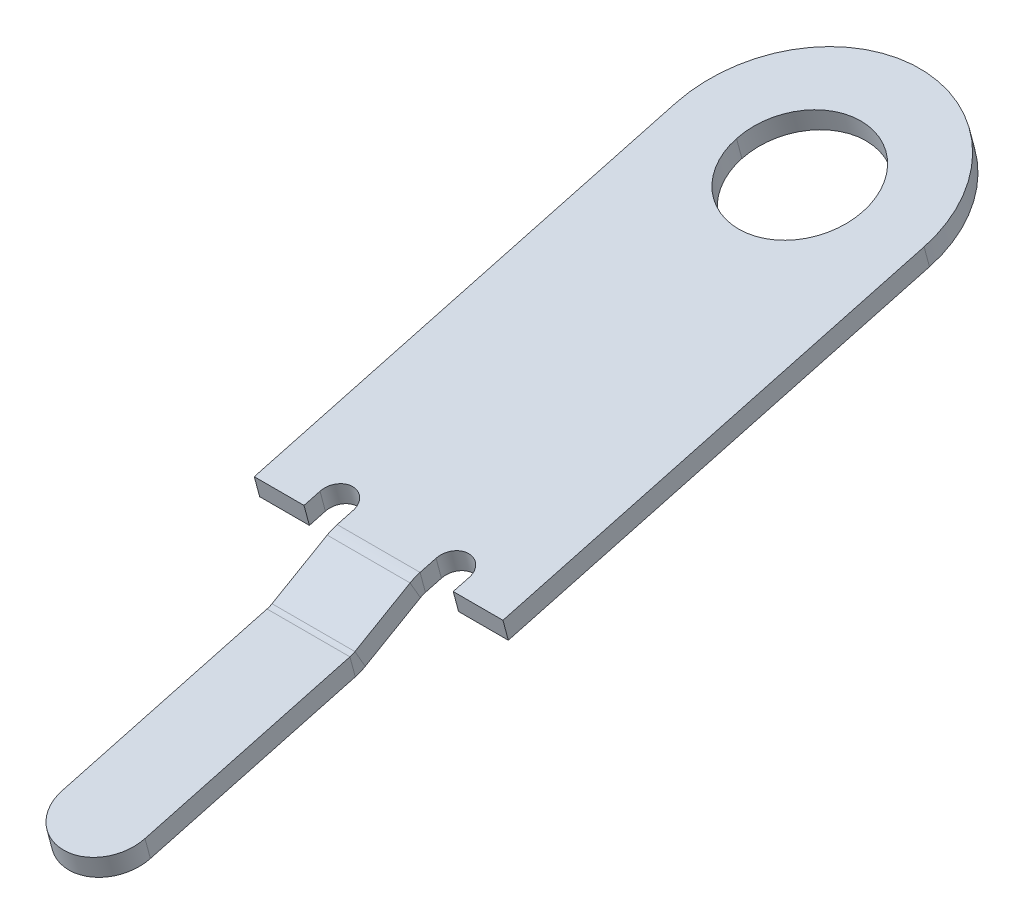
ISO-10303-21;
HEADER;
FILE_DESCRIPTION(('STEP AP214'),'2;1');
FILE_NAME('part.step','',(''),(''),'','','');
FILE_SCHEMA(('AUTOMOTIVE_DESIGN { 1 0 10303 214 1 1 1 1 }'));
ENDSEC;
DATA;
#1=APPLICATION_CONTEXT('core data for automotive mechanical design processes');
#2=APPLICATION_PROTOCOL_DEFINITION('international standard','automotive_design',2000,#1);
#3=PRODUCT_CONTEXT('',#1,'mechanical');
#4=PRODUCT('Part','Part','',(#3));
#5=PRODUCT_RELATED_PRODUCT_CATEGORY('part','',(#4));
#6=PRODUCT_DEFINITION_FORMATION('','',#4);
#7=PRODUCT_DEFINITION_CONTEXT('part definition',#1,'design');
#8=PRODUCT_DEFINITION('design','',#6,#7);
#9=PRODUCT_DEFINITION_SHAPE('','',#8);
#10=(LENGTH_UNIT() NAMED_UNIT(*) SI_UNIT(.MILLI.,.METRE.));
#11=(NAMED_UNIT(*) PLANE_ANGLE_UNIT() SI_UNIT($,.RADIAN.));
#12=(NAMED_UNIT(*) SI_UNIT($,.STERADIAN.) SOLID_ANGLE_UNIT());
#13=UNCERTAINTY_MEASURE_WITH_UNIT(LENGTH_MEASURE(1.E-05),#10,'distance_accuracy_value','');
#14=(GEOMETRIC_REPRESENTATION_CONTEXT(3) GLOBAL_UNCERTAINTY_ASSIGNED_CONTEXT((#13)) GLOBAL_UNIT_ASSIGNED_CONTEXT((#10,
#11,#12)) REPRESENTATION_CONTEXT('',''));
#15=CARTESIAN_POINT('',(0.,0.,0.));
#16=DIRECTION('',(0.,0.,1.));
#17=DIRECTION('',(1.,0.,0.));
#18=AXIS2_PLACEMENT_3D('',#15,#16,#17);
#19=CARTESIAN_POINT('',(0.,-0.7713127426711,8.654454381715));
#20=DIRECTION('',(0.,0.965925826289076,0.258819045102494));
#21=DIRECTION('',(-1.,0.,0.));
#22=AXIS2_PLACEMENT_3D('',#19,#20,#21);
#23=CYLINDRICAL_SURFACE('',#22,0.5);
#24=DIRECTION('',(0.,0.965925826289076,0.258819045102494));
#25=VECTOR('',#24,1.);
#26=CARTESIAN_POINT('',(0.5,-0.8920534709573,8.622102001078));
#27=LINE('',#26,#25);
#28=CARTESIAN_POINT('',(0.5,-0.8920534709573,8.622102001078));
#29=VERTEX_POINT('',#28);
#30=CARTESIAN_POINT('',(0.5,-0.650572014385,8.686806762353));
#31=VERTEX_POINT('',#30);
#32=EDGE_CURVE('E280',#29,#31,#27,.T.);
#33=ORIENTED_EDGE('',*,*,#32,.T.);
#34=CARTESIAN_POINT('',(0.,-0.650572014385,8.686806762353));
#35=DIRECTION('',(0.,-0.965925826289076,-0.258819045102494));
#36=DIRECTION('',(1.,0.,0.));
#37=AXIS2_PLACEMENT_3D('',#34,#35,#36);
#38=CIRCLE('',#37,0.5);
#39=CARTESIAN_POINT('',(-0.5,-0.650572014385,8.686806762353));
#40=VERTEX_POINT('',#39);
#41=EDGE_CURVE('E396',#31,#40,#38,.T.);
#42=ORIENTED_EDGE('',*,*,#41,.T.);
#43=DIRECTION('',(0.,0.965925826289076,0.258819045102494));
#44=VECTOR('',#43,1.);
#45=CARTESIAN_POINT('',(-0.5,-0.8920534709573,8.622102001078));
#46=LINE('',#45,#44);
#47=CARTESIAN_POINT('',(-0.5,-0.8920534709573,8.622102001078));
#48=VERTEX_POINT('',#47);
#49=EDGE_CURVE('E322',#48,#40,#46,.T.);
#50=ORIENTED_EDGE('',*,*,#49,.F.);
#51=CARTESIAN_POINT('',(0.,-0.8920534709573,8.622102001078));
#52=DIRECTION('',(0.,-0.965925826289076,-0.258819045102494));
#53=DIRECTION('',(1.,0.,0.));
#54=AXIS2_PLACEMENT_3D('',#51,#52,#53);
#55=CIRCLE('',#54,0.5);
#56=EDGE_CURVE('E279',#29,#48,#55,.T.);
#57=ORIENTED_EDGE('',*,*,#56,.F.);
#58=EDGE_LOOP('',(#33,#42,#50,#57));
#59=FACE_BOUND('',#58,.T.);
#60=ADVANCED_FACE('F17',(#59),#23,.T.);
#61=CARTESIAN_POINT('',(0.,1.711489338968,0.2554924532504));
#62=DIRECTION('',(0.,-0.965925826289076,-0.258819045102494));
#63=DIRECTION('',(-1.,0.,0.));
#64=AXIS2_PLACEMENT_3D('',#61,#62,#63);
#65=CYLINDRICAL_SURFACE('',#64,0.7625);
#66=DIRECTION('',(0.,0.965925826289076,0.258819045102494));
#67=VECTOR('',#66,1.);
#68=CARTESIAN_POINT('',(0.7625,1.590748610682,0.2231400726126));
#69=LINE('',#68,#67);
#70=CARTESIAN_POINT('',(0.7625,1.590748610682,0.2231400726126));
#71=VERTEX_POINT('',#70);
#72=CARTESIAN_POINT('',(0.7625,1.832230067254,0.2878448338882));
#73=VERTEX_POINT('',#72);
#74=EDGE_CURVE('E11',#71,#73,#69,.T.);
#75=ORIENTED_EDGE('',*,*,#74,.T.);
#76=CARTESIAN_POINT('',(0.,1.832230067254,0.2878448338882));
#77=DIRECTION('',(0.,-0.965925826289076,-0.258819045102494));
#78=DIRECTION('',(-1.,0.,0.));
#79=AXIS2_PLACEMENT_3D('',#76,#77,#78);
#80=CIRCLE('',#79,0.7625);
#81=CARTESIAN_POINT('',(-0.7625,1.832230067254,0.2878448338882));
#82=VERTEX_POINT('',#81);
#83=EDGE_CURVE('E487',#82,#73,#80,.T.);
#84=ORIENTED_EDGE('',*,*,#83,.F.);
#85=DIRECTION('',(0.,0.965925826289076,0.258819045102494));
#86=VECTOR('',#85,1.);
#87=CARTESIAN_POINT('',(-0.7625,1.590748610682,0.2231400726126));
#88=LINE('',#87,#86);
#89=CARTESIAN_POINT('',(-0.7625,1.590748610682,0.2231400726126));
#90=VERTEX_POINT('',#89);
#91=EDGE_CURVE('E25',#90,#82,#88,.T.);
#92=ORIENTED_EDGE('',*,*,#91,.F.);
#93=CARTESIAN_POINT('',(0.,1.590748610682,0.2231400726126));
#94=DIRECTION('',(0.,-0.965925826289076,-0.258819045102494));
#95=DIRECTION('',(-1.,0.,0.));
#96=AXIS2_PLACEMENT_3D('',#93,#94,#95);
#97=CIRCLE('',#96,0.7625);
#98=EDGE_CURVE('E251',#90,#71,#97,.T.);
#99=ORIENTED_EDGE('',*,*,#98,.T.);
#100=EDGE_LOOP('',(#75,#84,#92,#99));
#101=FACE_BOUND('',#100,.T.);
#102=ADVANCED_FACE('F495',(#101),#65,.F.);
#103=CARTESIAN_POINT('',(0.,1.711489338968,0.2554924532504));
#104=DIRECTION('',(0.,-0.965925826289076,-0.258819045102494));
#105=DIRECTION('',(1.,0.,0.));
#106=AXIS2_PLACEMENT_3D('',#103,#104,#105);
#107=CYLINDRICAL_SURFACE('',#106,0.7625);
#108=ORIENTED_EDGE('',*,*,#91,.T.);
#109=CARTESIAN_POINT('',(0.,1.832230067254,0.2878448338882));
#110=DIRECTION('',(0.,-0.965925826289076,-0.258819045102494));
#111=DIRECTION('',(1.,0.,0.));
#112=AXIS2_PLACEMENT_3D('',#109,#110,#111);
#113=CIRCLE('',#112,0.7625);
#114=EDGE_CURVE('E319',#73,#82,#113,.T.);
#115=ORIENTED_EDGE('',*,*,#114,.F.);
#116=ORIENTED_EDGE('',*,*,#74,.F.);
#117=CARTESIAN_POINT('',(0.,1.590748610682,0.2231400726126));
#118=DIRECTION('',(0.,-0.965925826289076,-0.258819045102494));
#119=DIRECTION('',(1.,0.,0.));
#120=AXIS2_PLACEMENT_3D('',#117,#118,#119);
#121=CIRCLE('',#120,0.7625);
#122=EDGE_CURVE('E240',#71,#90,#121,.T.);
#123=ORIENTED_EDGE('',*,*,#122,.T.);
#124=EDGE_LOOP('',(#108,#115,#116,#123));
#125=FACE_BOUND('',#124,.T.);
#126=ADVANCED_FACE('F498',(#125),#107,.F.);
#127=CARTESIAN_POINT('',(1.5,1.030795250349,2.795877376391));
#128=DIRECTION('',(-1.,0.,0.));
#129=DIRECTION('',(0.,0.,1.));
#130=AXIS2_PLACEMENT_3D('',#127,#128,#129);
#131=PLANE('',#130);
#132=DIRECTION('',(0.,0.965925826289076,0.258819045102494));
#133=VECTOR('',#132,1.);
#134=CARTESIAN_POINT('',(1.5,1.590748610682,0.2231400726126));
#135=LINE('',#134,#133);
#136=CARTESIAN_POINT('',(1.5,1.590748610682,0.2231400726126));
#137=VERTEX_POINT('',#136);
#138=CARTESIAN_POINT('',(1.5,1.832230067254,0.2878448338882));
#139=VERTEX_POINT('',#138);
#140=EDGE_CURVE('E318',#137,#139,#135,.T.);
#141=ORIENTED_EDGE('',*,*,#140,.T.);
#142=DIRECTION('',(0.,0.258819045102494,-0.965925826289076));
#143=VECTOR('',#142,1.);
#144=CARTESIAN_POINT('',(1.5,0.4708418900152,5.368614680169));
#145=LINE('',#144,#143);
#146=CARTESIAN_POINT('',(1.5,0.4708418900152,5.368614680169));
#147=VERTEX_POINT('',#146);
#148=EDGE_CURVE('E476',#147,#139,#145,.T.);
#149=ORIENTED_EDGE('',*,*,#148,.F.);
#150=DIRECTION('',(0.,0.965925826289076,0.258819045102494));
#151=VECTOR('',#150,1.);
#152=CARTESIAN_POINT('',(1.5,0.2293604334429,5.303909918893));
#153=LINE('',#152,#151);
#154=CARTESIAN_POINT('',(1.5,0.2293604334429,5.303909918893));
#155=VERTEX_POINT('',#154);
#156=EDGE_CURVE('E403',#155,#147,#153,.T.);
#157=ORIENTED_EDGE('',*,*,#156,.F.);
#158=DIRECTION('',(0.,0.258819045102494,-0.965925826289076));
#159=VECTOR('',#158,1.);
#160=CARTESIAN_POINT('',(1.5,0.2293604334429,5.303909918893));
#161=LINE('',#160,#159);
#162=EDGE_CURVE('E294',#155,#137,#161,.T.);
#163=ORIENTED_EDGE('',*,*,#162,.T.);
#164=EDGE_LOOP('',(#141,#149,#157,#163));
#165=FACE_BOUND('',#164,.T.);
#166=ADVANCED_FACE('F605',(#165),#131,.F.);
#167=CARTESIAN_POINT('',(0.,1.711489338968,0.2554924532504));
#168=DIRECTION('',(0.,0.965925826289076,0.258819045102494));
#169=DIRECTION('',(1.,0.,0.));
#170=AXIS2_PLACEMENT_3D('',#167,#168,#169);
#171=CYLINDRICAL_SURFACE('',#170,1.5);
#172=DIRECTION('',(0.,0.965925826289076,0.258819045102494));
#173=VECTOR('',#172,1.);
#174=CARTESIAN_POINT('',(-1.5,1.590748610682,0.2231400726126));
#175=LINE('',#174,#173);
#176=CARTESIAN_POINT('',(-1.5,1.590748610682,0.2231400726126));
#177=VERTEX_POINT('',#176);
#178=CARTESIAN_POINT('',(-1.5,1.832230067254,0.2878448338882));
#179=VERTEX_POINT('',#178);
#180=EDGE_CURVE('E315',#177,#179,#175,.T.);
#181=ORIENTED_EDGE('',*,*,#180,.T.);
#182=CARTESIAN_POINT('',(0.,1.832230067254,0.2878448338882));
#183=DIRECTION('',(0.,0.965925826289076,0.258819045102494));
#184=DIRECTION('',(1.,0.,0.));
#185=AXIS2_PLACEMENT_3D('',#182,#183,#184);
#186=CIRCLE('',#185,1.5);
#187=EDGE_CURVE('E480',#139,#179,#186,.T.);
#188=ORIENTED_EDGE('',*,*,#187,.F.);
#189=ORIENTED_EDGE('',*,*,#140,.F.);
#190=CARTESIAN_POINT('',(0.,1.590748610682,0.2231400726126));
#191=DIRECTION('',(0.,0.965925826289076,0.258819045102494));
#192=DIRECTION('',(1.,0.,0.));
#193=AXIS2_PLACEMENT_3D('',#190,#191,#192);
#194=CIRCLE('',#193,1.5);
#195=EDGE_CURVE('E266',#137,#177,#194,.T.);
#196=ORIENTED_EDGE('',*,*,#195,.T.);
#197=EDGE_LOOP('',(#181,#188,#189,#196));
#198=FACE_BOUND('',#197,.T.);
#199=ADVANCED_FACE('F581',(#198),#171,.T.);
#200=CARTESIAN_POINT('',(-1.5,1.030795250349,2.795877376391));
#201=DIRECTION('',(1.,0.,0.));
#202=DIRECTION('',(0.,1.,0.));
#203=AXIS2_PLACEMENT_3D('',#200,#201,#202);
#204=PLANE('',#203);
#205=DIRECTION('',(0.,0.965925826289076,0.258819045102494));
#206=VECTOR('',#205,1.);
#207=CARTESIAN_POINT('',(-1.5,0.2293604334429,5.303909918893));
#208=LINE('',#207,#206);
#209=CARTESIAN_POINT('',(-1.5,0.2293604334429,5.303909918893));
#210=VERTEX_POINT('',#209);
#211=CARTESIAN_POINT('',(-1.5,0.4708418900152,5.368614680169));
#212=VERTEX_POINT('',#211);
#213=EDGE_CURVE('E288',#210,#212,#208,.T.);
#214=ORIENTED_EDGE('',*,*,#213,.T.);
#215=DIRECTION('',(0.,-0.258819045102494,0.965925826289076));
#216=VECTOR('',#215,1.);
#217=CARTESIAN_POINT('',(-1.5,1.832230067254,0.2878448338882));
#218=LINE('',#217,#216);
#219=EDGE_CURVE('E484',#179,#212,#218,.T.);
#220=ORIENTED_EDGE('',*,*,#219,.F.);
#221=ORIENTED_EDGE('',*,*,#180,.F.);
#222=DIRECTION('',(0.,-0.258819045102494,0.965925826289076));
#223=VECTOR('',#222,1.);
#224=CARTESIAN_POINT('',(-1.5,1.590748610682,0.2231400726126));
#225=LINE('',#224,#223);
#226=EDGE_CURVE('E284',#177,#210,#225,.T.);
#227=ORIENTED_EDGE('',*,*,#226,.T.);
#228=EDGE_LOOP('',(#214,#220,#221,#227));
#229=FACE_BOUND('',#228,.T.);
#230=ADVANCED_FACE('F578',(#229),#204,.F.);
#231=CARTESIAN_POINT('',(0.,1.832230067254,0.2878448338882));
#232=DIRECTION('',(0.,0.965925826289076,0.258819045102494));
#233=DIRECTION('',(1.,0.,0.));
#234=AXIS2_PLACEMENT_3D('',#231,#232,#233);
#235=PLANE('',#234);
#236=ORIENTED_EDGE('',*,*,#83,.T.);
#237=ORIENTED_EDGE('',*,*,#114,.T.);
#238=EDGE_LOOP('',(#236,#237));
#239=FACE_BOUND('',#238,.T.);
#240=DIRECTION('',(0.,0.258819045102494,-0.965925826289076));
#241=VECTOR('',#240,1.);
#242=CARTESIAN_POINT('',(0.5,0.4708418900152,5.368614680169));
#243=LINE('',#242,#241);
#244=CARTESIAN_POINT('',(0.5,0.4708418900152,5.368614680169));
#245=VERTEX_POINT('',#244);
#246=CARTESIAN_POINT('',(0.5,0.5226056990357,5.175429514911));
#247=VERTEX_POINT('',#246);
#248=EDGE_CURVE('E355',#245,#247,#243,.T.);
#249=ORIENTED_EDGE('',*,*,#248,.T.);
#250=CARTESIAN_POINT('',(0.7,0.5226056990357,5.175429514911));
#251=DIRECTION('',(0.,0.965925826289076,0.258819045102494));
#252=DIRECTION('',(1.,0.,0.));
#253=AXIS2_PLACEMENT_3D('',#250,#251,#252);
#254=CIRCLE('',#253,0.2);
#255=CARTESIAN_POINT('',(0.9,0.5226056990357,5.175429514911));
#256=VERTEX_POINT('',#255);
#257=EDGE_CURVE('E356',#256,#247,#254,.T.);
#258=ORIENTED_EDGE('',*,*,#257,.F.);
#259=DIRECTION('',(0.,0.258819045102494,-0.965925826289076));
#260=VECTOR('',#259,1.);
#261=CARTESIAN_POINT('',(0.9,0.4708418900152,5.368614680169));
#262=LINE('',#261,#260);
#263=CARTESIAN_POINT('',(0.9,0.4708418900152,5.368614680169));
#264=VERTEX_POINT('',#263);
#265=EDGE_CURVE('E292',#264,#256,#262,.T.);
#266=ORIENTED_EDGE('',*,*,#265,.F.);
#267=DIRECTION('',(1.,0.,0.));
#268=VECTOR('',#267,1.);
#269=CARTESIAN_POINT('',(0.9,0.4708418900152,5.368614680169));
#270=LINE('',#269,#268);
#271=EDGE_CURVE('E407',#264,#147,#270,.T.);
#272=ORIENTED_EDGE('',*,*,#271,.T.);
#273=ORIENTED_EDGE('',*,*,#148,.T.);
#274=ORIENTED_EDGE('',*,*,#187,.T.);
#275=ORIENTED_EDGE('',*,*,#219,.T.);
#276=DIRECTION('',(1.,0.,0.));
#277=VECTOR('',#276,1.);
#278=CARTESIAN_POINT('',(-1.5,0.4708418900152,5.368614680169));
#279=LINE('',#278,#277);
#280=CARTESIAN_POINT('',(-0.9,0.4708418900152,5.368614680169));
#281=VERTEX_POINT('',#280);
#282=EDGE_CURVE('E293',#212,#281,#279,.T.);
#283=ORIENTED_EDGE('',*,*,#282,.T.);
#284=DIRECTION('',(0.,0.258819045102494,-0.965925826289076));
#285=VECTOR('',#284,1.);
#286=CARTESIAN_POINT('',(-0.9,0.4708418900152,5.368614680169));
#287=LINE('',#286,#285);
#288=CARTESIAN_POINT('',(-0.9,0.5226056990357,5.175429514911));
#289=VERTEX_POINT('',#288);
#290=EDGE_CURVE('E386',#281,#289,#287,.T.);
#291=ORIENTED_EDGE('',*,*,#290,.T.);
#292=CARTESIAN_POINT('',(-0.7,0.5226056990357,5.175429514911));
#293=DIRECTION('',(0.,0.965925826289076,0.258819045102494));
#294=DIRECTION('',(1.,0.,0.));
#295=AXIS2_PLACEMENT_3D('',#292,#293,#294);
#296=CIRCLE('',#295,0.2);
#297=CARTESIAN_POINT('',(-0.5,0.5226056990357,5.175429514911));
#298=VERTEX_POINT('',#297);
#299=EDGE_CURVE('E376',#298,#289,#296,.T.);
#300=ORIENTED_EDGE('',*,*,#299,.F.);
#301=DIRECTION('',(0.,0.258819045102494,-0.965925826289076));
#302=VECTOR('',#301,1.);
#303=CARTESIAN_POINT('',(-0.5,0.4708418900152,5.368614680169));
#304=LINE('',#303,#302);
#305=CARTESIAN_POINT('',(-0.5,0.4708418900152,5.368614680169));
#306=VERTEX_POINT('',#305);
#307=EDGE_CURVE('E226',#306,#298,#304,.T.);
#308=ORIENTED_EDGE('',*,*,#307,.F.);
#309=DIRECTION('',(1.,0.,0.));
#310=VECTOR('',#309,1.);
#311=CARTESIAN_POINT('',(-0.5,0.4708418900152,5.368614680169));
#312=LINE('',#311,#310);
#313=EDGE_CURVE('E473',#306,#245,#312,.T.);
#314=ORIENTED_EDGE('',*,*,#313,.T.);
#315=EDGE_LOOP('',(#249,#258,#266,#272,#273,#274,#275,#283,#291,#300,#308,#314));
#316=FACE_BOUND('',#315,.T.);
#317=ADVANCED_FACE('F493',(#239,#316),#235,.T.);
#318=CARTESIAN_POINT('',(-0.5,-0.01212102312933,5.239205157617));
#319=DIRECTION('',(1.,0.,0.));
#320=DIRECTION('',(0.,0.965925826289076,0.258819045102494));
#321=AXIS2_PLACEMENT_3D('',#318,#319,#320);
#322=CYLINDRICAL_SURFACE('',#321,0.5);
#323=CARTESIAN_POINT('',(0.5,-0.01212102312933,5.239205157617));
#324=DIRECTION('',(1.,0.,0.));
#325=DIRECTION('',(0.,0.965925826289076,0.258819045102494));
#326=AXIS2_PLACEMENT_3D('',#323,#324,#325);
#327=CIRCLE('',#326,0.5);
#328=CARTESIAN_POINT('',(0.5,0.4208916787629,5.489205157617));
#329=VERTEX_POINT('',#328);
#330=EDGE_CURVE('E387',#245,#329,#327,.T.);
#331=ORIENTED_EDGE('',*,*,#330,.F.);
#332=ORIENTED_EDGE('',*,*,#313,.F.);
#333=CARTESIAN_POINT('',(-0.5,-0.01212102312933,5.239205157617));
#334=DIRECTION('',(-1.,0.,0.));
#335=DIRECTION('',(0.,0.866025403784429,0.500000000000017));
#336=AXIS2_PLACEMENT_3D('',#333,#334,#335);
#337=CIRCLE('',#336,0.5);
#338=CARTESIAN_POINT('',(-0.5,0.4208916787629,5.489205157617));
#339=VERTEX_POINT('',#338);
#340=EDGE_CURVE('E221',#339,#306,#337,.T.);
#341=ORIENTED_EDGE('',*,*,#340,.F.);
#342=DIRECTION('',(1.,0.,0.));
#343=VECTOR('',#342,1.);
#344=CARTESIAN_POINT('',(-0.5,0.4208916787629,5.489205157617));
#345=LINE('',#344,#343);
#346=EDGE_CURVE('E448',#339,#329,#345,.T.);
#347=ORIENTED_EDGE('',*,*,#346,.T.);
#348=EDGE_LOOP('',(#331,#332,#341,#347));
#349=FACE_BOUND('',#348,.T.);
#350=ADVANCED_FACE('F617',(#349),#322,.T.);
#351=CARTESIAN_POINT('',(0.,3.094033268904,0.8591881076668));
#352=DIRECTION('',(0.,0.866025403784429,0.500000000000017));
#353=DIRECTION('',(1.,0.,0.));
#354=AXIS2_PLACEMENT_3D('',#351,#352,#353);
#355=PLANE('',#354);
#356=DIRECTION('',(0.,-0.500000000000017,0.866025403784429));
#357=VECTOR('',#356,1.);
#358=CARTESIAN_POINT('',(0.5,0.4208916787629,5.489205157617));
#359=LINE('',#358,#357);
#360=CARTESIAN_POINT('',(0.5,0.03677057268251,6.154522429608));
#361=VERTEX_POINT('',#360);
#362=EDGE_CURVE('E435',#329,#361,#359,.T.);
#363=ORIENTED_EDGE('',*,*,#362,.F.);
#364=ORIENTED_EDGE('',*,*,#346,.F.);
#365=DIRECTION('',(0.,0.500000000000017,-0.866025403784429));
#366=VECTOR('',#365,1.);
#367=CARTESIAN_POINT('',(-0.5,0.03677057268251,6.154522429608));
#368=LINE('',#367,#366);
#369=CARTESIAN_POINT('',(-0.5,0.03677057268251,6.154522429608));
#370=VERTEX_POINT('',#369);
#371=EDGE_CURVE('E373',#370,#339,#368,.T.);
#372=ORIENTED_EDGE('',*,*,#371,.F.);
#373=DIRECTION('',(1.,0.,0.));
#374=VECTOR('',#373,1.);
#375=CARTESIAN_POINT('',(-0.5,0.03677057268251,6.154522429608));
#376=LINE('',#375,#374);
#377=EDGE_CURVE('E445',#370,#361,#376,.T.);
#378=ORIENTED_EDGE('',*,*,#377,.T.);
#379=EDGE_LOOP('',(#363,#364,#372,#378));
#380=FACE_BOUND('',#379,.T.);
#381=ADVANCED_FACE('F554',(#380),#355,.T.);
#382=CARTESIAN_POINT('',(0.5,0.2532769236286,6.279522429608));
#383=DIRECTION('',(-1.,0.,0.));
#384=DIRECTION('',(0.,0.965925826289076,0.258819045102494));
#385=AXIS2_PLACEMENT_3D('',#382,#383,#384);
#386=CYLINDRICAL_SURFACE('',#385,0.25);
#387=CARTESIAN_POINT('',(-0.5,0.2532769236286,6.279522429608));
#388=DIRECTION('',(1.,0.,0.));
#389=DIRECTION('',(0.,-0.965925826289076,-0.258819045102494));
#390=AXIS2_PLACEMENT_3D('',#387,#388,#389);
#391=CIRCLE('',#390,0.25);
#392=CARTESIAN_POINT('',(-0.5,0.01179546705635,6.214817668333));
#393=VERTEX_POINT('',#392);
#394=EDGE_CURVE('E303',#393,#370,#391,.T.);
#395=ORIENTED_EDGE('',*,*,#394,.F.);
#396=DIRECTION('',(1.,0.,0.));
#397=VECTOR('',#396,1.);
#398=CARTESIAN_POINT('',(-0.5,0.01179546705635,6.214817668333));
#399=LINE('',#398,#397);
#400=CARTESIAN_POINT('',(0.5,0.01179546705635,6.214817668333));
#401=VERTEX_POINT('',#400);
#402=EDGE_CURVE('E399',#393,#401,#399,.T.);
#403=ORIENTED_EDGE('',*,*,#402,.T.);
#404=CARTESIAN_POINT('',(0.5,0.2532769236286,6.279522429608));
#405=DIRECTION('',(-1.,0.,0.));
#406=DIRECTION('',(0.,-0.866025403784429,-0.500000000000017));
#407=AXIS2_PLACEMENT_3D('',#404,#405,#406);
#408=CIRCLE('',#407,0.25);
#409=EDGE_CURVE('E429',#361,#401,#408,.T.);
#410=ORIENTED_EDGE('',*,*,#409,.F.);
#411=ORIENTED_EDGE('',*,*,#377,.F.);
#412=EDGE_LOOP('',(#395,#403,#410,#411));
#413=FACE_BOUND('',#412,.T.);
#414=ADVANCED_FACE('F538',(#413),#386,.F.);
#415=CARTESIAN_POINT('',(0.,1.616682820713,0.2252965240609));
#416=DIRECTION('',(0.,0.965925826289076,0.258819045102494));
#417=DIRECTION('',(1.,0.,0.));
#418=AXIS2_PLACEMENT_3D('',#415,#416,#417);
#419=PLANE('',#418);
#420=DIRECTION('',(0.,0.258819045102494,-0.965925826289076));
#421=VECTOR('',#420,1.);
#422=CARTESIAN_POINT('',(-0.5,-0.650572014385,8.686806762353));
#423=LINE('',#422,#421);
#424=EDGE_CURVE('E326',#40,#393,#423,.T.);
#425=ORIENTED_EDGE('',*,*,#424,.F.);
#426=ORIENTED_EDGE('',*,*,#41,.F.);
#427=DIRECTION('',(0.,-0.258819045102494,0.965925826289076));
#428=VECTOR('',#427,1.);
#429=CARTESIAN_POINT('',(0.5,0.01179546705635,6.214817668333));
#430=LINE('',#429,#428);
#431=EDGE_CURVE('E454',#401,#31,#430,.T.);
#432=ORIENTED_EDGE('',*,*,#431,.F.);
#433=ORIENTED_EDGE('',*,*,#402,.F.);
#434=EDGE_LOOP('',(#425,#426,#432,#433));
#435=FACE_BOUND('',#434,.T.);
#436=ADVANCED_FACE('F522',(#435),#419,.T.);
#437=CARTESIAN_POINT('',(-0.5,-0.3183794137417,6.964084185709));
#438=DIRECTION('',(1.,0.,0.));
#439=DIRECTION('',(0.,1.,0.));
#440=AXIS2_PLACEMENT_3D('',#437,#438,#439);
#441=PLANE('',#440);
#442=DIRECTION('',(0.,0.258819045102494,-0.965925826289076));
#443=VECTOR('',#442,1.);
#444=CARTESIAN_POINT('',(-0.5,-0.8920534709573,8.622102001078));
#445=LINE('',#444,#443);
#446=CARTESIAN_POINT('',(-0.5,-0.2296859895159,6.150112907057));
#447=VERTEX_POINT('',#446);
#448=EDGE_CURVE('E327',#48,#447,#445,.T.);
#449=ORIENTED_EDGE('',*,*,#448,.F.);
#450=ORIENTED_EDGE('',*,*,#49,.T.);
#451=ORIENTED_EDGE('',*,*,#424,.T.);
#452=DIRECTION('',(0.,-0.965925826289076,-0.258819045102494));
#453=VECTOR('',#452,1.);
#454=CARTESIAN_POINT('',(-0.5,0.01179546705635,6.214817668333));
#455=LINE('',#454,#453);
#456=EDGE_CURVE('E299',#393,#447,#455,.T.);
#457=ORIENTED_EDGE('',*,*,#456,.T.);
#458=EDGE_LOOP('',(#449,#450,#451,#457));
#459=FACE_BOUND('',#458,.T.);
#460=ADVANCED_FACE('F526',(#459),#441,.F.);
#461=CARTESIAN_POINT('',(0.,1.375201364141,0.1605917627853));
#462=DIRECTION('',(0.,0.965925826289076,0.258819045102494));
#463=DIRECTION('',(1.,0.,0.));
#464=AXIS2_PLACEMENT_3D('',#461,#462,#463);
#465=PLANE('',#464);
#466=DIRECTION('',(0.,-0.258819045102494,0.965925826289076));
#467=VECTOR('',#466,1.);
#468=CARTESIAN_POINT('',(0.5,-0.2296859895159,6.150112907057));
#469=LINE('',#468,#467);
#470=CARTESIAN_POINT('',(0.5,-0.2296859895159,6.150112907057));
#471=VERTEX_POINT('',#470);
#472=EDGE_CURVE('E275',#471,#29,#469,.T.);
#473=ORIENTED_EDGE('',*,*,#472,.T.);
#474=ORIENTED_EDGE('',*,*,#56,.T.);
#475=ORIENTED_EDGE('',*,*,#448,.T.);
#476=DIRECTION('',(1.,0.,0.));
#477=VECTOR('',#476,1.);
#478=CARTESIAN_POINT('',(-0.5,-0.2296859895159,6.150112907057));
#479=LINE('',#478,#477);
#480=EDGE_CURVE('E334',#447,#471,#479,.T.);
#481=ORIENTED_EDGE('',*,*,#480,.T.);
#482=EDGE_LOOP('',(#473,#474,#475,#481));
#483=FACE_BOUND('',#482,.T.);
#484=ADVANCED_FACE('F530',(#483),#465,.F.);
#485=CARTESIAN_POINT('',(0.5,-0.3183794137417,6.964084185709));
#486=DIRECTION('',(-1.,0.,0.));
#487=DIRECTION('',(0.,0.,1.));
#488=AXIS2_PLACEMENT_3D('',#485,#486,#487);
#489=PLANE('',#488);
#490=ORIENTED_EDGE('',*,*,#431,.T.);
#491=ORIENTED_EDGE('',*,*,#32,.F.);
#492=ORIENTED_EDGE('',*,*,#472,.F.);
#493=DIRECTION('',(0.,-0.965925826289076,-0.258819045102494));
#494=VECTOR('',#493,1.);
#495=CARTESIAN_POINT('',(0.5,0.01179546705635,6.214817668333));
#496=LINE('',#495,#494);
#497=EDGE_CURVE('E433',#401,#471,#496,.T.);
#498=ORIENTED_EDGE('',*,*,#497,.F.);
#499=EDGE_LOOP('',(#490,#491,#492,#498));
#500=FACE_BOUND('',#499,.T.);
#501=ADVANCED_FACE('F520',(#500),#489,.F.);
#502=CARTESIAN_POINT('',(0.5,-0.3183794137417,6.964084185709));
#503=DIRECTION('',(-1.,0.,0.));
#504=DIRECTION('',(0.,0.,1.));
#505=AXIS2_PLACEMENT_3D('',#502,#503,#504);
#506=PLANE('',#505);
#507=ORIENTED_EDGE('',*,*,#409,.T.);
#508=ORIENTED_EDGE('',*,*,#497,.T.);
#509=CARTESIAN_POINT('',(0.5,0.2532769236286,6.279522429608));
#510=DIRECTION('',(-1.,0.,0.));
#511=DIRECTION('',(0.,-0.866025403784429,-0.500000000000017));
#512=AXIS2_PLACEMENT_3D('',#509,#510,#511);
#513=CIRCLE('',#512,0.5);
#514=CARTESIAN_POINT('',(0.5,-0.1797357782636,6.029522429608));
#515=VERTEX_POINT('',#514);
#516=EDGE_CURVE('E330',#515,#471,#513,.T.);
#517=ORIENTED_EDGE('',*,*,#516,.F.);
#518=DIRECTION('',(0.,-0.866025403784429,-0.500000000000017));
#519=VECTOR('',#518,1.);
#520=CARTESIAN_POINT('',(0.5,0.03677057268251,6.154522429608));
#521=LINE('',#520,#519);
#522=EDGE_CURVE('E434',#361,#515,#521,.T.);
#523=ORIENTED_EDGE('',*,*,#522,.F.);
#524=EDGE_LOOP('',(#507,#508,#517,#523));
#525=FACE_BOUND('',#524,.T.);
#526=ADVANCED_FACE('F534',(#525),#506,.F.);
#527=CARTESIAN_POINT('',(0.5,-0.5192199065686,6.867526188196));
#528=DIRECTION('',(-1.,0.,0.));
#529=DIRECTION('',(0.,0.,1.));
#530=AXIS2_PLACEMENT_3D('',#527,#528,#529);
#531=PLANE('',#530);
#532=DIRECTION('',(0.,-0.500000000000017,0.866025403784429));
#533=VECTOR('',#532,1.);
#534=CARTESIAN_POINT('',(0.5,0.2043853278168,5.364205157617));
#535=LINE('',#534,#533);
#536=CARTESIAN_POINT('',(0.5,0.2043853278168,5.364205157617));
#537=VERTEX_POINT('',#536);
#538=EDGE_CURVE('E344',#537,#515,#535,.T.);
#539=ORIENTED_EDGE('',*,*,#538,.F.);
#540=DIRECTION('',(0.,-0.866025403784429,-0.500000000000017));
#541=VECTOR('',#540,1.);
#542=CARTESIAN_POINT('',(0.5,0.4208916787629,5.489205157617));
#543=LINE('',#542,#541);
#544=EDGE_CURVE('E391',#329,#537,#543,.T.);
#545=ORIENTED_EDGE('',*,*,#544,.F.);
#546=ORIENTED_EDGE('',*,*,#362,.T.);
#547=ORIENTED_EDGE('',*,*,#522,.T.);
#548=EDGE_LOOP('',(#539,#545,#546,#547));
#549=FACE_BOUND('',#548,.T.);
#550=ADVANCED_FACE('F551',(#549),#531,.F.);
#551=CARTESIAN_POINT('',(0.5,-0.1028321672003,7.026632495537));
#552=DIRECTION('',(-1.,0.,0.));
#553=DIRECTION('',(0.,0.,1.));
#554=AXIS2_PLACEMENT_3D('',#551,#552,#553);
#555=PLANE('',#554);
#556=CARTESIAN_POINT('',(0.5,-0.01212102312933,5.239205157617));
#557=DIRECTION('',(1.,0.,0.));
#558=DIRECTION('',(0.,0.965925826289076,0.258819045102494));
#559=AXIS2_PLACEMENT_3D('',#556,#557,#558);
#560=CIRCLE('',#559,0.25);
#561=CARTESIAN_POINT('',(0.5,0.2293604334429,5.303909918893));
#562=VERTEX_POINT('',#561);
#563=EDGE_CURVE('E239',#562,#537,#560,.T.);
#564=ORIENTED_EDGE('',*,*,#563,.F.);
#565=DIRECTION('',(0.,-0.965925826289076,-0.258819045102494));
#566=VECTOR('',#565,1.);
#567=CARTESIAN_POINT('',(0.5,0.4708418900152,5.368614680169));
#568=LINE('',#567,#566);
#569=EDGE_CURVE('E392',#245,#562,#568,.T.);
#570=ORIENTED_EDGE('',*,*,#569,.F.);
#571=ORIENTED_EDGE('',*,*,#330,.T.);
#572=ORIENTED_EDGE('',*,*,#544,.T.);
#573=EDGE_LOOP('',(#564,#570,#571,#572));
#574=FACE_BOUND('',#573,.T.);
#575=ADVANCED_FACE('F596',(#574),#555,.F.);
#576=CARTESIAN_POINT('',(0.5,0.3759830662393,5.239669716902));
#577=DIRECTION('',(-1.,0.,0.));
#578=DIRECTION('',(0.,0.,1.));
#579=AXIS2_PLACEMENT_3D('',#576,#577,#578);
#580=PLANE('',#579);
#581=DIRECTION('',(0.,0.258819045102494,-0.965925826289076));
#582=VECTOR('',#581,1.);
#583=CARTESIAN_POINT('',(0.5,0.2293604334429,5.303909918893));
#584=LINE('',#583,#582);
#585=CARTESIAN_POINT('',(0.5,0.2811242424634,5.110724753635));
#586=VERTEX_POINT('',#585);
#587=EDGE_CURVE('E249',#562,#586,#584,.T.);
#588=ORIENTED_EDGE('',*,*,#587,.T.);
#589=DIRECTION('',(0.,0.965925826289076,0.258819045102494));
#590=VECTOR('',#589,1.);
#591=CARTESIAN_POINT('',(0.5,0.2811242424634,5.110724753635));
#592=LINE('',#591,#590);
#593=EDGE_CURVE('E351',#586,#247,#592,.T.);
#594=ORIENTED_EDGE('',*,*,#593,.T.);
#595=ORIENTED_EDGE('',*,*,#248,.F.);
#596=ORIENTED_EDGE('',*,*,#569,.T.);
#597=EDGE_LOOP('',(#588,#594,#595,#596));
#598=FACE_BOUND('',#597,.T.);
#599=ADVANCED_FACE('F592',(#598),#580,.F.);
#600=CARTESIAN_POINT('',(0.7,0.4018649707496,5.143077134273));
#601=DIRECTION('',(0.,0.965925826289076,0.258819045102494));
#602=DIRECTION('',(1.,0.,0.));
#603=AXIS2_PLACEMENT_3D('',#600,#601,#602);
#604=CYLINDRICAL_SURFACE('',#603,0.2);
#605=DIRECTION('',(0.,0.965925826289076,0.258819045102494));
#606=VECTOR('',#605,1.);
#607=CARTESIAN_POINT('',(0.9,0.2811242424634,5.110724753635));
#608=LINE('',#607,#606);
#609=CARTESIAN_POINT('',(0.9,0.2811242424634,5.110724753635));
#610=VERTEX_POINT('',#609);
#611=EDGE_CURVE('E420',#610,#256,#608,.T.);
#612=ORIENTED_EDGE('',*,*,#611,.T.);
#613=ORIENTED_EDGE('',*,*,#257,.T.);
#614=ORIENTED_EDGE('',*,*,#593,.F.);
#615=CARTESIAN_POINT('',(0.7,0.2811242424634,5.110724753635));
#616=DIRECTION('',(0.,0.965925826289076,0.258819045102494));
#617=DIRECTION('',(1.,0.,0.));
#618=AXIS2_PLACEMENT_3D('',#615,#616,#617);
#619=CIRCLE('',#618,0.2);
#620=EDGE_CURVE('E312',#610,#586,#619,.T.);
#621=ORIENTED_EDGE('',*,*,#620,.F.);
#622=EDGE_LOOP('',(#612,#613,#614,#621));
#623=FACE_BOUND('',#622,.T.);
#624=ADVANCED_FACE('F589',(#623),#604,.F.);
#625=CARTESIAN_POINT('',(0.9,0.3759830662393,5.239669716902));
#626=DIRECTION('',(-1.,0.,0.));
#627=DIRECTION('',(0.,0.,1.));
#628=AXIS2_PLACEMENT_3D('',#625,#626,#627);
#629=PLANE('',#628);
#630=DIRECTION('',(0.,0.965925826289076,0.258819045102494));
#631=VECTOR('',#630,1.);
#632=CARTESIAN_POINT('',(0.9,0.2293604334429,5.303909918893));
#633=LINE('',#632,#631);
#634=CARTESIAN_POINT('',(0.9,0.2293604334429,5.303909918893));
#635=VERTEX_POINT('',#634);
#636=EDGE_CURVE('E411',#635,#264,#633,.T.);
#637=ORIENTED_EDGE('',*,*,#636,.T.);
#638=ORIENTED_EDGE('',*,*,#265,.T.);
#639=ORIENTED_EDGE('',*,*,#611,.F.);
#640=DIRECTION('',(0.,0.258819045102494,-0.965925826289076));
#641=VECTOR('',#640,1.);
#642=CARTESIAN_POINT('',(0.9,0.2293604334429,5.303909918893));
#643=LINE('',#642,#641);
#644=EDGE_CURVE('E308',#635,#610,#643,.T.);
#645=ORIENTED_EDGE('',*,*,#644,.F.);
#646=EDGE_LOOP('',(#637,#638,#639,#645));
#647=FACE_BOUND('',#646,.T.);
#648=ADVANCED_FACE('F587',(#647),#629,.T.);
#649=CARTESIAN_POINT('',(0.,0.3501011617291,5.336262299531));
#650=DIRECTION('',(0.,0.258819045102494,-0.965925826289076));
#651=DIRECTION('',(-1.,0.,0.));
#652=AXIS2_PLACEMENT_3D('',#649,#650,#651);
#653=PLANE('',#652);
#654=ORIENTED_EDGE('',*,*,#282,.F.);
#655=ORIENTED_EDGE('',*,*,#213,.F.);
#656=DIRECTION('',(1.,0.,0.));
#657=VECTOR('',#656,1.);
#658=CARTESIAN_POINT('',(-1.5,0.2293604334429,5.303909918893));
#659=LINE('',#658,#657);
#660=CARTESIAN_POINT('',(-0.9,0.2293604334429,5.303909918893));
#661=VERTEX_POINT('',#660);
#662=EDGE_CURVE('E272',#210,#661,#659,.T.);
#663=ORIENTED_EDGE('',*,*,#662,.T.);
#664=DIRECTION('',(0.,0.965925826289076,0.258819045102494));
#665=VECTOR('',#664,1.);
#666=CARTESIAN_POINT('',(-0.9,0.2293604334429,5.303909918893));
#667=LINE('',#666,#665);
#668=EDGE_CURVE('E395',#661,#281,#667,.T.);
#669=ORIENTED_EDGE('',*,*,#668,.T.);
#670=EDGE_LOOP('',(#654,#655,#663,#669));
#671=FACE_BOUND('',#670,.T.);
#672=ADVANCED_FACE('F583',(#671),#653,.F.);
#673=CARTESIAN_POINT('',(0.,0.3501011617291,5.336262299531));
#674=DIRECTION('',(0.,0.258819045102494,-0.965925826289076));
#675=DIRECTION('',(-1.,0.,0.));
#676=AXIS2_PLACEMENT_3D('',#673,#674,#675);
#677=PLANE('',#676);
#678=DIRECTION('',(1.,0.,0.));
#679=VECTOR('',#678,1.);
#680=CARTESIAN_POINT('',(0.9,0.2293604334429,5.303909918893));
#681=LINE('',#680,#679);
#682=EDGE_CURVE('E298',#635,#155,#681,.T.);
#683=ORIENTED_EDGE('',*,*,#682,.T.);
#684=ORIENTED_EDGE('',*,*,#156,.T.);
#685=ORIENTED_EDGE('',*,*,#271,.F.);
#686=ORIENTED_EDGE('',*,*,#636,.F.);
#687=EDGE_LOOP('',(#683,#684,#685,#686));
#688=FACE_BOUND('',#687,.T.);
#689=ADVANCED_FACE('F586',(#688),#677,.F.);
#690=CARTESIAN_POINT('',(-0.9,0.3759830662393,5.239669716902));
#691=DIRECTION('',(-1.,0.,0.));
#692=DIRECTION('',(0.,0.,1.));
#693=AXIS2_PLACEMENT_3D('',#690,#691,#692);
#694=PLANE('',#693);
#695=DIRECTION('',(0.,0.965925826289076,0.258819045102494));
#696=VECTOR('',#695,1.);
#697=CARTESIAN_POINT('',(-0.9,0.2811242424634,5.110724753635));
#698=LINE('',#697,#696);
#699=CARTESIAN_POINT('',(-0.9,0.2811242424634,5.110724753635));
#700=VERTEX_POINT('',#699);
#701=EDGE_CURVE('E380',#700,#289,#698,.T.);
#702=ORIENTED_EDGE('',*,*,#701,.T.);
#703=ORIENTED_EDGE('',*,*,#290,.F.);
#704=ORIENTED_EDGE('',*,*,#668,.F.);
#705=DIRECTION('',(0.,0.258819045102494,-0.965925826289076));
#706=VECTOR('',#705,1.);
#707=CARTESIAN_POINT('',(-0.9,0.2293604334429,5.303909918893));
#708=LINE('',#707,#706);
#709=EDGE_CURVE('E263',#661,#700,#708,.T.);
#710=ORIENTED_EDGE('',*,*,#709,.T.);
#711=EDGE_LOOP('',(#702,#703,#704,#710));
#712=FACE_BOUND('',#711,.T.);
#713=ADVANCED_FACE('F570',(#712),#694,.F.);
#714=CARTESIAN_POINT('',(-0.7,0.4018649707496,5.143077134273));
#715=DIRECTION('',(0.,0.965925826289076,0.258819045102494));
#716=DIRECTION('',(1.,0.,0.));
#717=AXIS2_PLACEMENT_3D('',#714,#715,#716);
#718=CYLINDRICAL_SURFACE('',#717,0.2);
#719=DIRECTION('',(0.,0.965925826289076,0.258819045102494));
#720=VECTOR('',#719,1.);
#721=CARTESIAN_POINT('',(-0.5,0.2811242424634,5.110724753635));
#722=LINE('',#721,#720);
#723=CARTESIAN_POINT('',(-0.5,0.2811242424634,5.110724753635));
#724=VERTEX_POINT('',#723);
#725=EDGE_CURVE('E255',#724,#298,#722,.T.);
#726=ORIENTED_EDGE('',*,*,#725,.T.);
#727=ORIENTED_EDGE('',*,*,#299,.T.);
#728=ORIENTED_EDGE('',*,*,#701,.F.);
#729=CARTESIAN_POINT('',(-0.7,0.2811242424634,5.110724753635));
#730=DIRECTION('',(0.,0.965925826289076,0.258819045102494));
#731=DIRECTION('',(1.,0.,0.));
#732=AXIS2_PLACEMENT_3D('',#729,#730,#731);
#733=CIRCLE('',#732,0.2);
#734=EDGE_CURVE('E258',#724,#700,#733,.T.);
#735=ORIENTED_EDGE('',*,*,#734,.F.);
#736=EDGE_LOOP('',(#726,#727,#728,#735));
#737=FACE_BOUND('',#736,.T.);
#738=ADVANCED_FACE('F574',(#737),#718,.F.);
#739=CARTESIAN_POINT('',(-0.5,0.3759830662393,5.239669716902));
#740=DIRECTION('',(-1.,0.,0.));
#741=DIRECTION('',(0.,0.,1.));
#742=AXIS2_PLACEMENT_3D('',#739,#740,#741);
#743=PLANE('',#742);
#744=ORIENTED_EDGE('',*,*,#307,.T.);
#745=ORIENTED_EDGE('',*,*,#725,.F.);
#746=DIRECTION('',(0.,0.258819045102494,-0.965925826289076));
#747=VECTOR('',#746,1.);
#748=CARTESIAN_POINT('',(-0.5,0.2293604334429,5.303909918893));
#749=LINE('',#748,#747);
#750=CARTESIAN_POINT('',(-0.5,0.2293604334429,5.303909918893));
#751=VERTEX_POINT('',#750);
#752=EDGE_CURVE('E246',#751,#724,#749,.T.);
#753=ORIENTED_EDGE('',*,*,#752,.F.);
#754=DIRECTION('',(0.,-0.965925826289076,-0.258819045102494));
#755=VECTOR('',#754,1.);
#756=CARTESIAN_POINT('',(-0.5,0.4708418900152,5.368614680169));
#757=LINE('',#756,#755);
#758=EDGE_CURVE('E215',#306,#751,#757,.T.);
#759=ORIENTED_EDGE('',*,*,#758,.F.);
#760=EDGE_LOOP('',(#744,#745,#753,#759));
#761=FACE_BOUND('',#760,.T.);
#762=ADVANCED_FACE('F253',(#761),#743,.T.);
#763=CARTESIAN_POINT('',(-0.5,-0.1028321672003,7.026632495537));
#764=DIRECTION('',(1.,0.,0.));
#765=DIRECTION('',(0.,1.,0.));
#766=AXIS2_PLACEMENT_3D('',#763,#764,#765);
#767=PLANE('',#766);
#768=ORIENTED_EDGE('',*,*,#340,.T.);
#769=ORIENTED_EDGE('',*,*,#758,.T.);
#770=CARTESIAN_POINT('',(-0.5,-0.01212102312933,5.239205157617));
#771=DIRECTION('',(-1.,0.,0.));
#772=DIRECTION('',(0.,0.866025403784429,0.500000000000017));
#773=AXIS2_PLACEMENT_3D('',#770,#771,#772);
#774=CIRCLE('',#773,0.25);
#775=CARTESIAN_POINT('',(-0.5,0.2043853278168,5.364205157617));
#776=VERTEX_POINT('',#775);
#777=EDGE_CURVE('E219',#776,#751,#774,.T.);
#778=ORIENTED_EDGE('',*,*,#777,.F.);
#779=DIRECTION('',(0.,-0.866025403784429,-0.500000000000017));
#780=VECTOR('',#779,1.);
#781=CARTESIAN_POINT('',(-0.5,0.4208916787629,5.489205157617));
#782=LINE('',#781,#780);
#783=EDGE_CURVE('E311',#339,#776,#782,.T.);
#784=ORIENTED_EDGE('',*,*,#783,.F.);
#785=EDGE_LOOP('',(#768,#769,#778,#784));
#786=FACE_BOUND('',#785,.T.);
#787=ADVANCED_FACE('F217',(#786),#767,.F.);
#788=CARTESIAN_POINT('',(-0.5,-0.5192199065686,6.867526188196));
#789=DIRECTION('',(1.,0.,0.));
#790=DIRECTION('',(0.,1.,0.));
#791=AXIS2_PLACEMENT_3D('',#788,#789,#790);
#792=PLANE('',#791);
#793=ORIENTED_EDGE('',*,*,#371,.T.);
#794=ORIENTED_EDGE('',*,*,#783,.T.);
#795=DIRECTION('',(0.,0.500000000000017,-0.866025403784429));
#796=VECTOR('',#795,1.);
#797=CARTESIAN_POINT('',(-0.5,-0.1797357782636,6.029522429608));
#798=LINE('',#797,#796);
#799=CARTESIAN_POINT('',(-0.5,-0.1797357782636,6.029522429608));
#800=VERTEX_POINT('',#799);
#801=EDGE_CURVE('E340',#800,#776,#798,.T.);
#802=ORIENTED_EDGE('',*,*,#801,.F.);
#803=DIRECTION('',(0.,-0.866025403784429,-0.500000000000017));
#804=VECTOR('',#803,1.);
#805=CARTESIAN_POINT('',(-0.5,0.03677057268251,6.154522429608));
#806=LINE('',#805,#804);
#807=EDGE_CURVE('E370',#370,#800,#806,.T.);
#808=ORIENTED_EDGE('',*,*,#807,.F.);
#809=EDGE_LOOP('',(#793,#794,#802,#808));
#810=FACE_BOUND('',#809,.T.);
#811=ADVANCED_FACE('F559',(#810),#792,.F.);
#812=CARTESIAN_POINT('',(-0.5,-0.3183794137417,6.964084185709));
#813=DIRECTION('',(1.,0.,0.));
#814=DIRECTION('',(0.,1.,0.));
#815=AXIS2_PLACEMENT_3D('',#812,#813,#814);
#816=PLANE('',#815);
#817=CARTESIAN_POINT('',(-0.5,0.2532769236286,6.279522429608));
#818=DIRECTION('',(1.,0.,0.));
#819=DIRECTION('',(0.,-0.965925826289076,-0.258819045102494));
#820=AXIS2_PLACEMENT_3D('',#817,#818,#819);
#821=CIRCLE('',#820,0.5);
#822=EDGE_CURVE('E304',#447,#800,#821,.T.);
#823=ORIENTED_EDGE('',*,*,#822,.F.);
#824=ORIENTED_EDGE('',*,*,#456,.F.);
#825=ORIENTED_EDGE('',*,*,#394,.T.);
#826=ORIENTED_EDGE('',*,*,#807,.T.);
#827=EDGE_LOOP('',(#823,#824,#825,#826));
#828=FACE_BOUND('',#827,.T.);
#829=ADVANCED_FACE('F541',(#828),#816,.F.);
#830=CARTESIAN_POINT('',(0.5,0.2532769236286,6.279522429608));
#831=DIRECTION('',(-1.,0.,0.));
#832=DIRECTION('',(0.,0.965925826289076,0.258819045102494));
#833=AXIS2_PLACEMENT_3D('',#830,#831,#832);
#834=CYLINDRICAL_SURFACE('',#833,0.5);
#835=ORIENTED_EDGE('',*,*,#516,.T.);
#836=ORIENTED_EDGE('',*,*,#480,.F.);
#837=ORIENTED_EDGE('',*,*,#822,.T.);
#838=DIRECTION('',(1.,0.,0.));
#839=VECTOR('',#838,1.);
#840=CARTESIAN_POINT('',(-0.5,-0.1797357782636,6.029522429608));
#841=LINE('',#840,#839);
#842=EDGE_CURVE('E335',#800,#515,#841,.T.);
#843=ORIENTED_EDGE('',*,*,#842,.T.);
#844=EDGE_LOOP('',(#835,#836,#837,#843));
#845=FACE_BOUND('',#844,.T.);
#846=ADVANCED_FACE('F545',(#845),#834,.T.);
#847=CARTESIAN_POINT('',(0.,2.877526917958,0.7341881076668));
#848=DIRECTION('',(0.,0.866025403784429,0.500000000000017));
#849=DIRECTION('',(1.,0.,0.));
#850=AXIS2_PLACEMENT_3D('',#847,#848,#849);
#851=PLANE('',#850);
#852=ORIENTED_EDGE('',*,*,#801,.T.);
#853=DIRECTION('',(1.,0.,0.));
#854=VECTOR('',#853,1.);
#855=CARTESIAN_POINT('',(-0.5,0.2043853278168,5.364205157617));
#856=LINE('',#855,#854);
#857=EDGE_CURVE('E237',#776,#537,#856,.T.);
#858=ORIENTED_EDGE('',*,*,#857,.T.);
#859=ORIENTED_EDGE('',*,*,#538,.T.);
#860=ORIENTED_EDGE('',*,*,#842,.F.);
#861=EDGE_LOOP('',(#852,#858,#859,#860));
#862=FACE_BOUND('',#861,.T.);
#863=ADVANCED_FACE('F507',(#862),#851,.F.);
#864=CARTESIAN_POINT('',(-0.5,-0.01212102312933,5.239205157617));
#865=DIRECTION('',(1.,0.,0.));
#866=DIRECTION('',(0.,0.965925826289076,0.258819045102494));
#867=AXIS2_PLACEMENT_3D('',#864,#865,#866);
#868=CYLINDRICAL_SURFACE('',#867,0.25);
#869=ORIENTED_EDGE('',*,*,#777,.T.);
#870=DIRECTION('',(1.,0.,0.));
#871=VECTOR('',#870,1.);
#872=CARTESIAN_POINT('',(-0.5,0.2293604334429,5.303909918893));
#873=LINE('',#872,#871);
#874=EDGE_CURVE('E234',#751,#562,#873,.T.);
#875=ORIENTED_EDGE('',*,*,#874,.T.);
#876=ORIENTED_EDGE('',*,*,#563,.T.);
#877=ORIENTED_EDGE('',*,*,#857,.F.);
#878=EDGE_LOOP('',(#869,#875,#876,#877));
#879=FACE_BOUND('',#878,.T.);
#880=ADVANCED_FACE('F232',(#879),#868,.F.);
#881=CARTESIAN_POINT('',(0.,1.590748610682,0.2231400726126));
#882=DIRECTION('',(0.,0.965925826289076,0.258819045102494));
#883=DIRECTION('',(1.,0.,0.));
#884=AXIS2_PLACEMENT_3D('',#881,#882,#883);
#885=PLANE('',#884);
#886=ORIENTED_EDGE('',*,*,#98,.F.);
#887=ORIENTED_EDGE('',*,*,#122,.F.);
#888=EDGE_LOOP('',(#886,#887));
#889=FACE_BOUND('',#888,.T.);
#890=ORIENTED_EDGE('',*,*,#752,.T.);
#891=ORIENTED_EDGE('',*,*,#734,.T.);
#892=ORIENTED_EDGE('',*,*,#709,.F.);
#893=ORIENTED_EDGE('',*,*,#662,.F.);
#894=ORIENTED_EDGE('',*,*,#226,.F.);
#895=ORIENTED_EDGE('',*,*,#195,.F.);
#896=ORIENTED_EDGE('',*,*,#162,.F.);
#897=ORIENTED_EDGE('',*,*,#682,.F.);
#898=ORIENTED_EDGE('',*,*,#644,.T.);
#899=ORIENTED_EDGE('',*,*,#620,.T.);
#900=ORIENTED_EDGE('',*,*,#587,.F.);
#901=ORIENTED_EDGE('',*,*,#874,.F.);
#902=EDGE_LOOP('',(#890,#891,#892,#893,#894,#895,#896,#897,#898,#899,#900,#901));
#903=FACE_BOUND('',#902,.T.);
#904=ADVANCED_FACE('F244',(#889,#903),#885,.F.);
#905=CLOSED_SHELL('',(#60,#102,#126,#166,#199,#230,#317,#350,#381,#414,#436,#460,#484,#501,#526,
#550,#575,#599,#624,#648,#672,#689,#713,#738,#762,#787,#811,#829,#846,#863,#880,#904));
#906=MANIFOLD_SOLID_BREP('B1',#905);
#907=ADVANCED_BREP_SHAPE_REPRESENTATION('',(#18,#906),#14);
#908=SHAPE_DEFINITION_REPRESENTATION(#9,#907);
ENDSEC;
END-ISO-10303-21;
